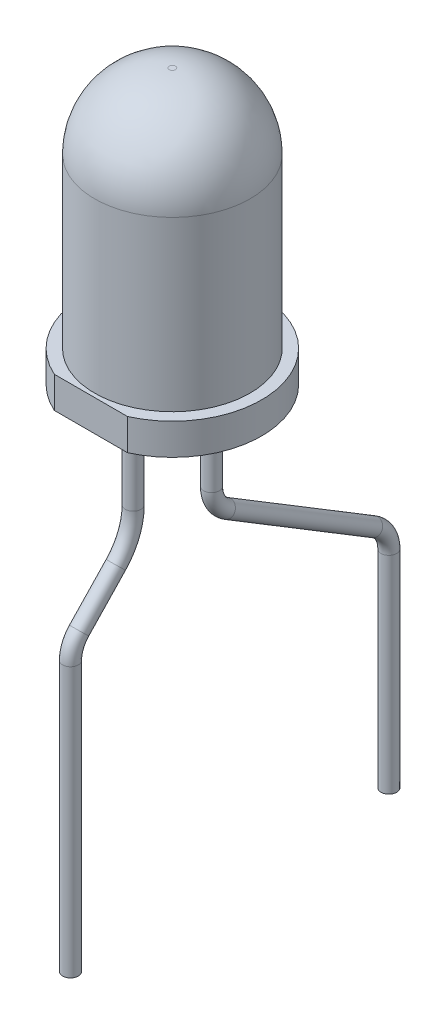
ISO-10303-21;
HEADER;
FILE_DESCRIPTION(('STEP AP214'),'2;1');
FILE_NAME('part.step','',(''),(''),'','','');
FILE_SCHEMA(('AUTOMOTIVE_DESIGN { 1 0 10303 214 1 1 1 1 }'));
ENDSEC;
DATA;
#1=APPLICATION_CONTEXT('core data for automotive mechanical design processes');
#2=APPLICATION_PROTOCOL_DEFINITION('international standard','automotive_design',2000,#1);
#3=PRODUCT_CONTEXT('',#1,'mechanical');
#4=PRODUCT('Part','Part','',(#3));
#5=PRODUCT_RELATED_PRODUCT_CATEGORY('part','',(#4));
#6=PRODUCT_DEFINITION_FORMATION('','',#4);
#7=PRODUCT_DEFINITION_CONTEXT('part definition',#1,'design');
#8=PRODUCT_DEFINITION('design','',#6,#7);
#9=PRODUCT_DEFINITION_SHAPE('','',#8);
#10=(LENGTH_UNIT() NAMED_UNIT(*) SI_UNIT(.MILLI.,.METRE.));
#11=(NAMED_UNIT(*) PLANE_ANGLE_UNIT() SI_UNIT($,.RADIAN.));
#12=(NAMED_UNIT(*) SI_UNIT($,.STERADIAN.) SOLID_ANGLE_UNIT());
#13=UNCERTAINTY_MEASURE_WITH_UNIT(LENGTH_MEASURE(1.E-05),#10,'distance_accuracy_value','');
#14=(GEOMETRIC_REPRESENTATION_CONTEXT(3) GLOBAL_UNCERTAINTY_ASSIGNED_CONTEXT((#13)) GLOBAL_UNIT_ASSIGNED_CONTEXT((#10,
#11,#12)) REPRESENTATION_CONTEXT('',''));
#15=CARTESIAN_POINT('',(0.,0.,0.));
#16=DIRECTION('',(0.,0.,1.));
#17=DIRECTION('',(1.,0.,0.));
#18=AXIS2_PLACEMENT_3D('',#15,#16,#17);
#19=CARTESIAN_POINT('',(0.,0.,0.));
#20=DIRECTION('',(0.,-1.,0.));
#21=DIRECTION('',(0.,0.,-1.));
#22=AXIS2_PLACEMENT_3D('',#19,#20,#21);
#23=PLANE('',#22);
#24=CARTESIAN_POINT('',(0.,0.,1.25));
#25=DIRECTION('',(0.,-1.,0.));
#26=DIRECTION('',(0.,0.,-1.));
#27=AXIS2_PLACEMENT_3D('',#24,#25,#26);
#28=CIRCLE('',#27,0.25);
#29=CARTESIAN_POINT('',(0.,0.,1.));
#30=VERTEX_POINT('',#29);
#31=EDGE_CURVE('E88',#30,#30,#28,.T.);
#32=ORIENTED_EDGE('',*,*,#31,.F.);
#33=EDGE_LOOP('',(#32));
#34=FACE_BOUND('',#33,.T.);
#35=CARTESIAN_POINT('',(0.,0.,-1.25));
#36=DIRECTION('',(0.,-1.,0.));
#37=DIRECTION('',(0.,0.,-1.));
#38=AXIS2_PLACEMENT_3D('',#35,#36,#37);
#39=CIRCLE('',#38,0.25);
#40=CARTESIAN_POINT('',(0.,0.,-1.5));
#41=VERTEX_POINT('',#40);
#42=EDGE_CURVE('E85',#41,#41,#39,.T.);
#43=ORIENTED_EDGE('',*,*,#42,.F.);
#44=EDGE_LOOP('',(#43));
#45=FACE_BOUND('',#44,.T.);
#46=DIRECTION('',(1.,0.,0.));
#47=VECTOR('',#46,1.);
#48=CARTESIAN_POINT('',(-1.16726175299288,0.,2.6));
#49=LINE('',#48,#47);
#50=CARTESIAN_POINT('',(-1.16726175299288,0.,2.6));
#51=VERTEX_POINT('',#50);
#52=CARTESIAN_POINT('',(1.16726175299288,0.,2.6));
#53=VERTEX_POINT('',#52);
#54=EDGE_CURVE('E65',#51,#53,#49,.T.);
#55=ORIENTED_EDGE('',*,*,#54,.F.);
#56=CARTESIAN_POINT('',(0.,0.,0.));
#57=DIRECTION('',(0.,-1.,0.));
#58=DIRECTION('',(0.,0.,-1.));
#59=AXIS2_PLACEMENT_3D('',#56,#57,#58);
#60=CIRCLE('',#59,2.85);
#61=EDGE_CURVE('E11',#51,#53,#60,.T.);
#62=ORIENTED_EDGE('',*,*,#61,.T.);
#63=EDGE_LOOP('',(#55,#62));
#64=FACE_BOUND('',#63,.T.);
#65=ADVANCED_FACE('F36',(#34,#45,#64),#23,.T.);
#66=CARTESIAN_POINT('',(0.,0.,0.));
#67=DIRECTION('',(0.,-1.,0.));
#68=DIRECTION('',(0.,0.,-1.));
#69=AXIS2_PLACEMENT_3D('',#66,#67,#68);
#70=CYLINDRICAL_SURFACE('',#69,2.85);
#71=DIRECTION('',(0.,-1.,0.));
#72=VECTOR('',#71,1.);
#73=CARTESIAN_POINT('',(1.16726175299288,3.34787137637478,2.6));
#74=LINE('',#73,#72);
#75=CARTESIAN_POINT('',(1.16726175299288,1.,2.6));
#76=VERTEX_POINT('',#75);
#77=EDGE_CURVE('E50',#76,#53,#74,.T.);
#78=ORIENTED_EDGE('',*,*,#77,.T.);
#79=ORIENTED_EDGE('',*,*,#61,.F.);
#80=DIRECTION('',(0.,-1.,0.));
#81=VECTOR('',#80,1.);
#82=CARTESIAN_POINT('',(-1.16726175299288,3.34787137637478,2.6));
#83=LINE('',#82,#81);
#84=CARTESIAN_POINT('',(-1.16726175299288,1.,2.6));
#85=VERTEX_POINT('',#84);
#86=EDGE_CURVE('E56',#85,#51,#83,.T.);
#87=ORIENTED_EDGE('',*,*,#86,.F.);
#88=CARTESIAN_POINT('',(0.,1.,0.));
#89=DIRECTION('',(0.,-1.,0.));
#90=DIRECTION('',(0.,0.,-1.));
#91=AXIS2_PLACEMENT_3D('',#88,#89,#90);
#92=CIRCLE('',#91,2.85);
#93=EDGE_CURVE('E43',#85,#76,#92,.T.);
#94=ORIENTED_EDGE('',*,*,#93,.T.);
#95=EDGE_LOOP('',(#78,#79,#87,#94));
#96=FACE_BOUND('',#95,.T.);
#97=ADVANCED_FACE('F69',(#96),#70,.T.);
#98=CARTESIAN_POINT('',(2.85,1.,0.));
#99=DIRECTION('',(0.,1.,0.));
#100=DIRECTION('',(0.,0.,1.));
#101=AXIS2_PLACEMENT_3D('',#98,#99,#100);
#102=PLANE('',#101);
#103=DIRECTION('',(1.,0.,0.));
#104=VECTOR('',#103,1.);
#105=CARTESIAN_POINT('',(-1.16726175299288,1.,2.6));
#106=LINE('',#105,#104);
#107=EDGE_CURVE('E60',#85,#76,#106,.T.);
#108=ORIENTED_EDGE('',*,*,#107,.T.);
#109=ORIENTED_EDGE('',*,*,#93,.F.);
#110=EDGE_LOOP('',(#108,#109));
#111=FACE_BOUND('',#110,.T.);
#112=CARTESIAN_POINT('',(0.,1.,0.));
#113=DIRECTION('',(0.,-1.,0.));
#114=DIRECTION('',(0.,0.,-1.));
#115=AXIS2_PLACEMENT_3D('',#112,#113,#114);
#116=CIRCLE('',#115,2.48);
#117=CARTESIAN_POINT('',(0.,1.,-2.48));
#118=VERTEX_POINT('',#117);
#119=EDGE_CURVE('E74',#118,#118,#116,.T.);
#120=ORIENTED_EDGE('',*,*,#119,.T.);
#121=EDGE_LOOP('',(#120));
#122=FACE_BOUND('',#121,.T.);
#123=ADVANCED_FACE('F72',(#111,#122),#102,.T.);
#124=CARTESIAN_POINT('',(0.,0.,0.));
#125=DIRECTION('',(0.,-1.,0.));
#126=DIRECTION('',(0.,0.,-1.));
#127=AXIS2_PLACEMENT_3D('',#124,#125,#126);
#128=CYLINDRICAL_SURFACE('',#127,2.48);
#129=CARTESIAN_POINT('',(0.,6.37,0.));
#130=DIRECTION('',(0.,-1.,0.));
#131=DIRECTION('',(0.,0.,-1.));
#132=AXIS2_PLACEMENT_3D('',#129,#130,#131);
#133=CIRCLE('',#132,2.48);
#134=CARTESIAN_POINT('',(0.,6.37,-2.48));
#135=VERTEX_POINT('',#134);
#136=EDGE_CURVE('E76',#135,#135,#133,.T.);
#137=ORIENTED_EDGE('',*,*,#136,.T.);
#138=EDGE_LOOP('',(#137));
#139=FACE_BOUND('',#138,.T.);
#140=ORIENTED_EDGE('',*,*,#119,.F.);
#141=EDGE_LOOP('',(#140));
#142=FACE_BOUND('',#141,.T.);
#143=ADVANCED_FACE('F299',(#139,#142),#128,.T.);
#144=CARTESIAN_POINT('',(0.,6.37,0.));
#145=DIRECTION('',(0.,-1.,0.));
#146=DIRECTION('',(0.,0.,-1.));
#147=AXIS2_PLACEMENT_3D('',#144,#145,#146);
#148=DEGENERATE_TOROIDAL_SURFACE('',#147,0.1,2.38,.T.);
#149=CARTESIAN_POINT('',(0.,8.75,0.));
#150=DIRECTION('',(0.,-1.,0.));
#151=DIRECTION('',(0.,0.,-1.));
#152=AXIS2_PLACEMENT_3D('',#149,#150,#151);
#153=CIRCLE('',#152,0.1);
#154=CARTESIAN_POINT('',(0.,8.75,-0.1));
#155=VERTEX_POINT('',#154);
#156=EDGE_CURVE('E70',#155,#155,#153,.T.);
#157=ORIENTED_EDGE('',*,*,#156,.T.);
#158=EDGE_LOOP('',(#157));
#159=FACE_BOUND('',#158,.T.);
#160=ORIENTED_EDGE('',*,*,#136,.F.);
#161=EDGE_LOOP('',(#160));
#162=FACE_BOUND('',#161,.T.);
#163=ADVANCED_FACE('F314',(#159,#162),#148,.T.);
#164=CARTESIAN_POINT('',(0.,8.75,0.));
#165=DIRECTION('',(0.,1.,0.));
#166=DIRECTION('',(0.,0.,1.));
#167=AXIS2_PLACEMENT_3D('',#164,#165,#166);
#168=PLANE('',#167);
#169=ORIENTED_EDGE('',*,*,#156,.F.);
#170=EDGE_LOOP('',(#169));
#171=FACE_BOUND('',#170,.T.);
#172=ADVANCED_FACE('F137',(#171),#168,.T.);
#173=CARTESIAN_POINT('',(-1.16726175299288,3.34787137637478,2.6));
#174=DIRECTION('',(0.,0.,-1.));
#175=DIRECTION('',(-1.,0.,0.));
#176=AXIS2_PLACEMENT_3D('',#173,#174,#175);
#177=PLANE('',#176);
#178=ORIENTED_EDGE('',*,*,#86,.T.);
#179=ORIENTED_EDGE('',*,*,#54,.T.);
#180=ORIENTED_EDGE('',*,*,#77,.F.);
#181=ORIENTED_EDGE('',*,*,#107,.F.);
#182=EDGE_LOOP('',(#178,#179,#180,#181));
#183=FACE_BOUND('',#182,.T.);
#184=ADVANCED_FACE('F61',(#183),#177,.F.);
#185=CARTESIAN_POINT('',(0.,-2.,-1.25));
#186=DIRECTION('',(0.,1.,0.));
#187=DIRECTION('',(0.,0.,1.));
#188=AXIS2_PLACEMENT_3D('',#185,#186,#187);
#189=CYLINDRICAL_SURFACE('',#188,0.25);
#190=ORIENTED_EDGE('',*,*,#42,.T.);
#191=EDGE_LOOP('',(#190));
#192=FACE_BOUND('',#191,.T.);
#193=CARTESIAN_POINT('',(0.,-3.43733882567167,-1.25));
#194=DIRECTION('',(0.,-1.,0.));
#195=DIRECTION('',(0.,0.,-1.));
#196=AXIS2_PLACEMENT_3D('',#193,#194,#195);
#197=CIRCLE('',#196,0.25);
#198=CARTESIAN_POINT('',(0.,-3.43733882567167,-1.));
#199=VERTEX_POINT('',#198);
#200=EDGE_CURVE('E118',#199,#199,#197,.T.);
#201=ORIENTED_EDGE('',*,*,#200,.F.);
#202=EDGE_LOOP('',(#201));
#203=FACE_BOUND('',#202,.T.);
#204=ADVANCED_FACE('F124',(#192,#203),#189,.T.);
#205=CARTESIAN_POINT('',(0.,-2.,1.25));
#206=DIRECTION('',(0.,1.,0.));
#207=DIRECTION('',(0.,0.,1.));
#208=AXIS2_PLACEMENT_3D('',#205,#206,#207);
#209=CYLINDRICAL_SURFACE('',#208,0.25);
#210=ORIENTED_EDGE('',*,*,#31,.T.);
#211=EDGE_LOOP('',(#210));
#212=FACE_BOUND('',#211,.T.);
#213=CARTESIAN_POINT('',(0.,-2.7,1.25));
#214=DIRECTION('',(0.,-1.,0.));
#215=DIRECTION('',(0.,0.,-1.));
#216=AXIS2_PLACEMENT_3D('',#213,#214,#215);
#217=CIRCLE('',#216,0.25);
#218=CARTESIAN_POINT('',(0.,-2.7,1.));
#219=VERTEX_POINT('',#218);
#220=EDGE_CURVE('E103',#219,#219,#217,.T.);
#221=ORIENTED_EDGE('',*,*,#220,.F.);
#222=EDGE_LOOP('',(#221));
#223=FACE_BOUND('',#222,.T.);
#224=ADVANCED_FACE('F126',(#212,#223),#209,.T.);
#225=CARTESIAN_POINT('',(0.,-14.6,3.25));
#226=DIRECTION('',(0.,-1.,0.));
#227=DIRECTION('',(0.,0.,-1.));
#228=AXIS2_PLACEMENT_3D('',#225,#226,#227);
#229=PLANE('',#228);
#230=CARTESIAN_POINT('',(0.,-14.6,3.25));
#231=DIRECTION('',(0.,-1.,0.));
#232=DIRECTION('',(0.,0.,-1.));
#233=AXIS2_PLACEMENT_3D('',#230,#231,#232);
#234=CIRCLE('',#233,0.25);
#235=CARTESIAN_POINT('',(0.,-14.6,3.));
#236=VERTEX_POINT('',#235);
#237=EDGE_CURVE('E91',#236,#236,#234,.T.);
#238=ORIENTED_EDGE('',*,*,#237,.T.);
#239=EDGE_LOOP('',(#238));
#240=FACE_BOUND('',#239,.T.);
#241=ADVANCED_FACE('F133',(#240),#229,.T.);
#242=CARTESIAN_POINT('',(0.,-2.7,3.25));
#243=DIRECTION('',(-1.,0.,0.));
#244=DIRECTION('',(0.,0.,1.));
#245=AXIS2_PLACEMENT_3D('',#242,#243,#244);
#246=TOROIDAL_SURFACE('',#245,2.,0.25);
#247=CARTESIAN_POINT('',(0.,-4.07931034482759,1.80172413793103));
#248=DIRECTION('',(0.,-0.724137931034485,0.689655172413791));
#249=DIRECTION('',(0.,-0.689655172413791,-0.724137931034485));
#250=AXIS2_PLACEMENT_3D('',#247,#248,#249);
#251=CIRCLE('',#250,0.25);
#252=CARTESIAN_POINT('',(0.,-4.25172413793103,1.62068965517241));
#253=VERTEX_POINT('',#252);
#254=EDGE_CURVE('E100',#253,#253,#251,.T.);
#255=CARTESIAN_POINT('',(0.,-2.7,3.25));
#256=DIRECTION('',(-1.,0.,0.));
#257=DIRECTION('',(0.,0.,1.));
#258=AXIS2_PLACEMENT_3D('',#255,#256,#257);
#259=CIRCLE('',#258,2.25);
#260=EDGE_CURVE('',#219,#253,#259,.T.);
#261=ORIENTED_EDGE('',*,*,#220,.T.);
#262=ORIENTED_EDGE('',*,*,#254,.F.);
#263=ORIENTED_EDGE('',*,*,#260,.T.);
#264=ORIENTED_EDGE('',*,*,#260,.F.);
#265=EDGE_LOOP('',(#261,#263,#262,#264));
#266=FACE_BOUND('',#265,.T.);
#267=ADVANCED_FACE('F151',(#266),#246,.T.);
#268=CARTESIAN_POINT('',(0.,-4.07931034482759,1.80172413793103));
#269=DIRECTION('',(0.,-0.724137931034485,0.689655172413791));
#270=DIRECTION('',(0.,-0.689655172413791,-0.724137931034485));
#271=AXIS2_PLACEMENT_3D('',#268,#269,#270);
#272=CYLINDRICAL_SURFACE('',#271,0.25);
#273=CARTESIAN_POINT('',(0.,-5.31034482758622,2.97413793103448));
#274=DIRECTION('',(0.,-0.724137931034485,0.689655172413791));
#275=DIRECTION('',(0.,-0.689655172413791,-0.724137931034485));
#276=AXIS2_PLACEMENT_3D('',#273,#274,#275);
#277=CIRCLE('',#276,0.25);
#278=CARTESIAN_POINT('',(0.,-5.13793103448277,3.1551724137931));
#279=VERTEX_POINT('',#278);
#280=EDGE_CURVE('E97',#279,#279,#277,.T.);
#281=ORIENTED_EDGE('',*,*,#280,.F.);
#282=EDGE_LOOP('',(#281));
#283=FACE_BOUND('',#282,.T.);
#284=ORIENTED_EDGE('',*,*,#254,.T.);
#285=EDGE_LOOP('',(#284));
#286=FACE_BOUND('',#285,.T.);
#287=ADVANCED_FACE('F153',(#283,#286),#272,.T.);
#288=CARTESIAN_POINT('',(0.,-6.00000000000001,2.25));
#289=DIRECTION('',(1.,0.,0.));
#290=DIRECTION('',(0.,0.,-1.));
#291=AXIS2_PLACEMENT_3D('',#288,#289,#290);
#292=TOROIDAL_SURFACE('',#291,0.999999999999997,0.25);
#293=CARTESIAN_POINT('',(0.,-6.00000000000001,3.25));
#294=DIRECTION('',(0.,-1.,0.));
#295=DIRECTION('',(0.,0.,-1.));
#296=AXIS2_PLACEMENT_3D('',#293,#294,#295);
#297=CIRCLE('',#296,0.25);
#298=CARTESIAN_POINT('',(0.,-6.00000000000001,3.5));
#299=VERTEX_POINT('',#298);
#300=EDGE_CURVE('E94',#299,#299,#297,.T.);
#301=CARTESIAN_POINT('',(0.,-6.00000000000001,2.25));
#302=DIRECTION('',(1.,0.,0.));
#303=DIRECTION('',(0.,0.,-1.));
#304=AXIS2_PLACEMENT_3D('',#301,#302,#303);
#305=CIRCLE('',#304,1.25);
#306=EDGE_CURVE('',#279,#299,#305,.T.);
#307=ORIENTED_EDGE('',*,*,#280,.T.);
#308=ORIENTED_EDGE('',*,*,#300,.F.);
#309=ORIENTED_EDGE('',*,*,#306,.T.);
#310=ORIENTED_EDGE('',*,*,#306,.F.);
#311=EDGE_LOOP('',(#307,#309,#308,#310));
#312=FACE_BOUND('',#311,.T.);
#313=ADVANCED_FACE('F160',(#312),#292,.T.);
#314=CARTESIAN_POINT('',(0.,-6.00000000000001,3.25));
#315=DIRECTION('',(0.,-1.,0.));
#316=DIRECTION('',(0.,0.,-1.));
#317=AXIS2_PLACEMENT_3D('',#314,#315,#316);
#318=CYLINDRICAL_SURFACE('',#317,0.25);
#319=ORIENTED_EDGE('',*,*,#237,.F.);
#320=EDGE_LOOP('',(#319));
#321=FACE_BOUND('',#320,.T.);
#322=ORIENTED_EDGE('',*,*,#300,.T.);
#323=EDGE_LOOP('',(#322));
#324=FACE_BOUND('',#323,.T.);
#325=ADVANCED_FACE('F136',(#321,#324),#318,.T.);
#326=CARTESIAN_POINT('',(0.,-14.6,-6.91));
#327=DIRECTION('',(0.,-1.,0.));
#328=DIRECTION('',(0.,0.,-1.));
#329=AXIS2_PLACEMENT_3D('',#326,#327,#328);
#330=PLANE('',#329);
#331=CARTESIAN_POINT('',(0.,-14.6,-6.91));
#332=DIRECTION('',(0.,-1.,0.));
#333=DIRECTION('',(0.,0.,-1.));
#334=AXIS2_PLACEMENT_3D('',#331,#332,#333);
#335=CIRCLE('',#334,0.25);
#336=CARTESIAN_POINT('',(0.,-14.6,-7.16));
#337=VERTEX_POINT('',#336);
#338=EDGE_CURVE('E106',#337,#337,#335,.T.);
#339=ORIENTED_EDGE('',*,*,#338,.T.);
#340=EDGE_LOOP('',(#339));
#341=FACE_BOUND('',#340,.T.);
#342=ADVANCED_FACE('F168',(#341),#330,.T.);
#343=CARTESIAN_POINT('',(0.,-3.43733882567167,-2.25));
#344=DIRECTION('',(1.,0.,0.));
#345=DIRECTION('',(0.,0.,-1.));
#346=AXIS2_PLACEMENT_3D('',#343,#344,#345);
#347=TOROIDAL_SURFACE('',#346,0.999999999999998,0.25);
#348=CARTESIAN_POINT('',(0.,-4.29206535593698,-1.73092143324866));
#349=DIRECTION('',(0.,-0.519078566751339,-0.85472653026531));
#350=DIRECTION('',(0.,0.85472653026531,-0.519078566751339));
#351=AXIS2_PLACEMENT_3D('',#348,#349,#350);
#352=CIRCLE('',#351,0.25);
#353=CARTESIAN_POINT('',(0.,-4.5057469885033,-1.60115179156083));
#354=VERTEX_POINT('',#353);
#355=EDGE_CURVE('E115',#354,#354,#352,.T.);
#356=CARTESIAN_POINT('',(0.,-3.43733882567167,-2.25));
#357=DIRECTION('',(1.,0.,0.));
#358=DIRECTION('',(0.,0.,-1.));
#359=AXIS2_PLACEMENT_3D('',#356,#357,#358);
#360=CIRCLE('',#359,1.25);
#361=EDGE_CURVE('',#199,#354,#360,.T.);
#362=ORIENTED_EDGE('',*,*,#200,.T.);
#363=ORIENTED_EDGE('',*,*,#355,.F.);
#364=ORIENTED_EDGE('',*,*,#361,.T.);
#365=ORIENTED_EDGE('',*,*,#361,.F.);
#366=EDGE_LOOP('',(#362,#364,#363,#365));
#367=FACE_BOUND('',#366,.T.);
#368=ADVANCED_FACE('F122',(#367),#347,.T.);
#369=CARTESIAN_POINT('',(0.,-4.29206535593698,-1.73092143324866));
#370=DIRECTION('',(0.,-0.519078566751339,-0.85472653026531));
#371=DIRECTION('',(0.,0.85472653026531,-0.519078566751339));
#372=AXIS2_PLACEMENT_3D('',#369,#370,#371);
#373=CYLINDRICAL_SURFACE('',#372,0.25);
#374=CARTESIAN_POINT('',(0.,-7.14527346973469,-6.42907856675134));
#375=DIRECTION('',(0.,-0.519078566751339,-0.85472653026531));
#376=DIRECTION('',(0.,0.85472653026531,-0.519078566751339));
#377=AXIS2_PLACEMENT_3D('',#374,#375,#376);
#378=CIRCLE('',#377,0.25);
#379=CARTESIAN_POINT('',(0.,-6.93159183716836,-6.55884820843917));
#380=VERTEX_POINT('',#379);
#381=EDGE_CURVE('E112',#380,#380,#378,.T.);
#382=ORIENTED_EDGE('',*,*,#381,.F.);
#383=EDGE_LOOP('',(#382));
#384=FACE_BOUND('',#383,.T.);
#385=ORIENTED_EDGE('',*,*,#355,.T.);
#386=EDGE_LOOP('',(#385));
#387=FACE_BOUND('',#386,.T.);
#388=ADVANCED_FACE('F189',(#384,#387),#373,.T.);
#389=CARTESIAN_POINT('',(0.,-8.,-5.91));
#390=DIRECTION('',(-1.,0.,0.));
#391=DIRECTION('',(0.,0.,1.));
#392=AXIS2_PLACEMENT_3D('',#389,#390,#391);
#393=TOROIDAL_SURFACE('',#392,0.999999999999999,0.25);
#394=CARTESIAN_POINT('',(0.,-8.,-6.91));
#395=DIRECTION('',(0.,-1.,0.));
#396=DIRECTION('',(0.,0.,-1.));
#397=AXIS2_PLACEMENT_3D('',#394,#395,#396);
#398=CIRCLE('',#397,0.25);
#399=CARTESIAN_POINT('',(0.,-8.,-7.16));
#400=VERTEX_POINT('',#399);
#401=EDGE_CURVE('E109',#400,#400,#398,.T.);
#402=CARTESIAN_POINT('',(0.,-8.,-5.91));
#403=DIRECTION('',(-1.,0.,0.));
#404=DIRECTION('',(0.,0.,1.));
#405=AXIS2_PLACEMENT_3D('',#402,#403,#404);
#406=CIRCLE('',#405,1.25);
#407=EDGE_CURVE('',#380,#400,#406,.T.);
#408=ORIENTED_EDGE('',*,*,#381,.T.);
#409=ORIENTED_EDGE('',*,*,#401,.F.);
#410=ORIENTED_EDGE('',*,*,#407,.T.);
#411=ORIENTED_EDGE('',*,*,#407,.F.);
#412=EDGE_LOOP('',(#408,#410,#409,#411));
#413=FACE_BOUND('',#412,.T.);
#414=ADVANCED_FACE('F196',(#413),#393,.T.);
#415=CARTESIAN_POINT('',(0.,-8.,-6.91));
#416=DIRECTION('',(0.,-1.,0.));
#417=DIRECTION('',(0.,0.,-1.));
#418=AXIS2_PLACEMENT_3D('',#415,#416,#417);
#419=CYLINDRICAL_SURFACE('',#418,0.25);
#420=ORIENTED_EDGE('',*,*,#338,.F.);
#421=EDGE_LOOP('',(#420));
#422=FACE_BOUND('',#421,.T.);
#423=ORIENTED_EDGE('',*,*,#401,.T.);
#424=EDGE_LOOP('',(#423));
#425=FACE_BOUND('',#424,.T.);
#426=ADVANCED_FACE('F165',(#422,#425),#419,.T.);
#427=CLOSED_SHELL('',(#65,#97,#123,#143,#163,#172,#184,#204,#224,#241,#267,#287,#313,#325,#342,
#368,#388,#414,#426));
#428=MANIFOLD_SOLID_BREP('B2',#427);
#429=ADVANCED_BREP_SHAPE_REPRESENTATION('',(#18,#428),#14);
#430=SHAPE_DEFINITION_REPRESENTATION(#9,#429);
ENDSEC;
END-ISO-10303-21;
